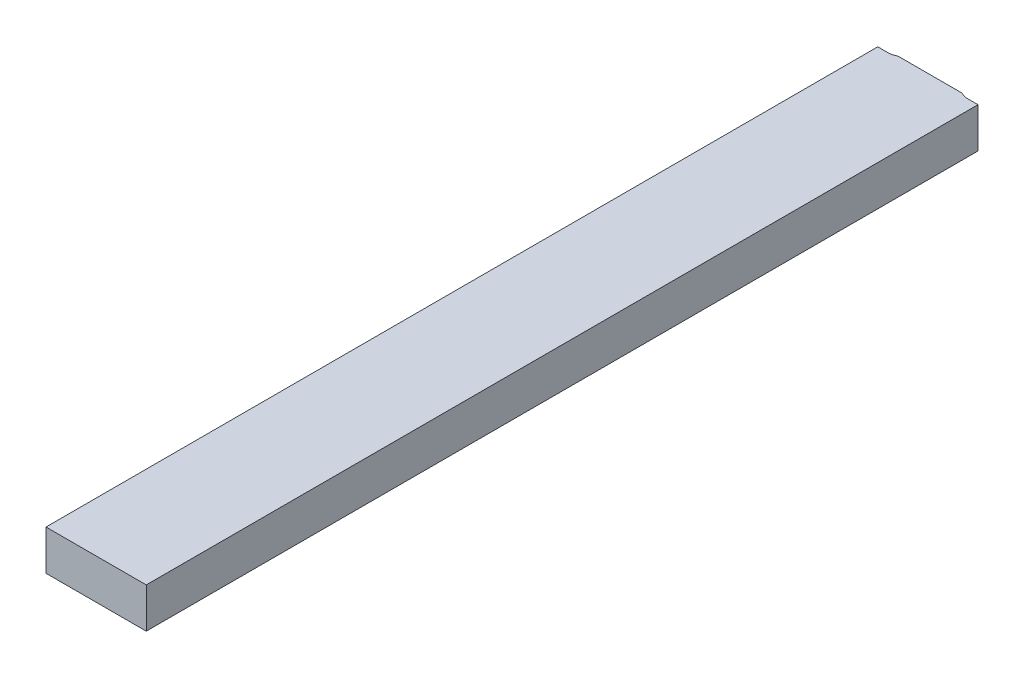
ISO-10303-21;
HEADER;
FILE_DESCRIPTION(('STEP AP214'),'2;1');
FILE_NAME('part.step','',(''),(''),'','','');
FILE_SCHEMA(('AUTOMOTIVE_DESIGN { 1 0 10303 214 1 1 1 1 }'));
ENDSEC;
DATA;
#1=APPLICATION_CONTEXT('core data for automotive mechanical design processes');
#2=APPLICATION_PROTOCOL_DEFINITION('international standard','automotive_design',2000,#1);
#3=PRODUCT_CONTEXT('',#1,'mechanical');
#4=PRODUCT('Part','Part','',(#3));
#5=PRODUCT_RELATED_PRODUCT_CATEGORY('part','',(#4));
#6=PRODUCT_DEFINITION_FORMATION('','',#4);
#7=PRODUCT_DEFINITION_CONTEXT('part definition',#1,'design');
#8=PRODUCT_DEFINITION('design','',#6,#7);
#9=PRODUCT_DEFINITION_SHAPE('','',#8);
#10=(LENGTH_UNIT() NAMED_UNIT(*) SI_UNIT(.MILLI.,.METRE.));
#11=(NAMED_UNIT(*) PLANE_ANGLE_UNIT() SI_UNIT($,.RADIAN.));
#12=(NAMED_UNIT(*) SI_UNIT($,.STERADIAN.) SOLID_ANGLE_UNIT());
#13=UNCERTAINTY_MEASURE_WITH_UNIT(LENGTH_MEASURE(1.E-05),#10,'distance_accuracy_value','');
#14=(GEOMETRIC_REPRESENTATION_CONTEXT(3) GLOBAL_UNCERTAINTY_ASSIGNED_CONTEXT((#13)) GLOBAL_UNIT_ASSIGNED_CONTEXT((#10,
#11,#12)) REPRESENTATION_CONTEXT('',''));
#15=CARTESIAN_POINT('',(0.,0.,0.));
#16=DIRECTION('',(0.,0.,1.));
#17=DIRECTION('',(1.,0.,0.));
#18=AXIS2_PLACEMENT_3D('',#15,#16,#17);
#19=CARTESIAN_POINT('',(-1.5,0.275,-4.982138483571));
#20=DIRECTION('',(0.,1.,0.));
#21=DIRECTION('',(0.,0.,1.));
#22=AXIS2_PLACEMENT_3D('',#19,#20,#21);
#23=PLANE('',#22);
#24=DIRECTION('',(1.,0.,0.));
#25=VECTOR('',#24,1.);
#26=CARTESIAN_POINT('',(-1.725,0.275,-7.051158663985));
#27=LINE('',#26,#25);
#28=CARTESIAN_POINT('',(-1.75,0.275,-7.051158663985));
#29=VERTEX_POINT('',#28);
#30=CARTESIAN_POINT('',(-1.69999999999826,0.275,-7.05115866398515));
#31=VERTEX_POINT('',#30);
#32=EDGE_CURVE('E184',#29,#31,#27,.T.);
#33=ORIENTED_EDGE('',*,*,#32,.T.);
#34=CARTESIAN_POINT('',(-1.66074390617903,0.275,-7.06145062487904));
#35=CARTESIAN_POINT('',(-1.66430562065387,0.275,-7.05943829430755));
#36=CARTESIAN_POINT('',(-1.66802308541288,0.275,-7.05770911016996));
#37=CARTESIAN_POINT('',(-1.675678668398,0.275,-7.05483826908998));
#38=CARTESIAN_POINT('',(-1.67961678669287,0.275,-7.05369661233063));
#39=CARTESIAN_POINT('',(-1.68899940611308,0.275,-7.05173413514556));
#40=CARTESIAN_POINT('',(-1.6944962200161,0.275,-7.05115865434742));
#41=CARTESIAN_POINT('',(-1.69999999999652,0.275,-7.05115866398529));
#42=B_SPLINE_CURVE_WITH_KNOTS('',3,(#34,#35,#36,#37,#38,#39,#40,#41),.UNSPECIFIED.,.F.,.F.,(4,2,
2,4),(0.,0.0122542009828669,0.0245084057837984,0.040976648284799),.UNSPECIFIED.);
#43=CARTESIAN_POINT('',(-1.66074390617903,0.275,-7.06145062487903));
#44=VERTEX_POINT('',#43);
#45=EDGE_CURVE('E93',#44,#31,#42,.T.);
#46=ORIENTED_EDGE('',*,*,#45,.F.);
#47=DIRECTION('',(1.,0.,0.));
#48=VECTOR('',#47,1.);
#49=CARTESIAN_POINT('',(-1.499999951795,0.275,-7.061450624879));
#50=LINE('',#49,#48);
#51=CARTESIAN_POINT('',(-1.339255997412,0.275,-7.06145062487899));
#52=VERTEX_POINT('',#51);
#53=EDGE_CURVE('E89',#44,#52,#50,.T.);
#54=ORIENTED_EDGE('',*,*,#53,.T.);
#55=CARTESIAN_POINT('',(-1.30000000000351,0.275,-7.05115866398509));
#56=CARTESIAN_POINT('',(-1.30408879277278,0.275,-7.05116284562048));
#57=CARTESIAN_POINT('',(-1.30817611333355,0.275,-7.05148113218099));
#58=CARTESIAN_POINT('',(-1.31625667415824,0.275,-7.05273057454798));
#59=CARTESIAN_POINT('',(-1.32024989952298,0.275,-7.05366182674584));
#60=CARTESIAN_POINT('',(-1.32939082766556,0.275,-7.05654480111922));
#61=CARTESIAN_POINT('',(-1.33446335028937,0.275,-7.05873731135742));
#62=CARTESIAN_POINT('',(-1.339255997412,0.275,-7.06145062487899));
#63=B_SPLINE_CURVE_WITH_KNOTS('',3,(#55,#56,#57,#58,#59,#60,#61,#62),.UNSPECIFIED.,.F.,.F.,(4,2,
2,4),(0.,0.0122527379750503,0.0245074032044935,0.0409759652394009),.UNSPECIFIED.);
#64=CARTESIAN_POINT('',(-1.30000000000176,0.275,-7.05115866398505));
#65=VERTEX_POINT('',#64);
#66=EDGE_CURVE('E21',#65,#52,#63,.T.);
#67=ORIENTED_EDGE('',*,*,#66,.F.);
#68=DIRECTION('',(1.,0.,0.));
#69=VECTOR('',#68,1.);
#70=CARTESIAN_POINT('',(-1.275,0.275,-7.051158663985));
#71=LINE('',#70,#69);
#72=CARTESIAN_POINT('',(-1.25,0.275,-7.051158663985));
#73=VERTEX_POINT('',#72);
#74=EDGE_CURVE('E84',#65,#73,#71,.T.);
#75=ORIENTED_EDGE('',*,*,#74,.T.);
#76=DIRECTION('',(0.,0.,-1.));
#77=VECTOR('',#76,1.);
#78=CARTESIAN_POINT('',(-1.25,0.275,-4.976992503125));
#79=LINE('',#78,#77);
#80=CARTESIAN_POINT('',(-1.25,0.275,-2.902826342264));
#81=VERTEX_POINT('',#80);
#82=EDGE_CURVE('E218',#81,#73,#79,.T.);
#83=ORIENTED_EDGE('',*,*,#82,.F.);
#84=DIRECTION('',(1.,0.,0.));
#85=VECTOR('',#84,1.);
#86=CARTESIAN_POINT('',(-1.5,0.275,-2.902826342264));
#87=LINE('',#86,#85);
#88=CARTESIAN_POINT('',(-1.75,0.275,-2.902826342264));
#89=VERTEX_POINT('',#88);
#90=EDGE_CURVE('E204',#89,#81,#87,.T.);
#91=ORIENTED_EDGE('',*,*,#90,.F.);
#92=DIRECTION('',(0.,0.,-1.));
#93=VECTOR('',#92,1.);
#94=CARTESIAN_POINT('',(-1.75,0.275,-4.976992503125));
#95=LINE('',#94,#93);
#96=EDGE_CURVE('E176',#89,#29,#95,.T.);
#97=ORIENTED_EDGE('',*,*,#96,.T.);
#98=EDGE_LOOP('',(#33,#46,#54,#67,#75,#83,#91,#97));
#99=FACE_BOUND('',#98,.T.);
#100=ADVANCED_FACE('F17',(#99),#23,.F.);
#101=CARTESIAN_POINT('',(-1.25,0.375,-4.976992503125));
#102=DIRECTION('',(1.,0.,0.));
#103=DIRECTION('',(0.,0.,-1.));
#104=AXIS2_PLACEMENT_3D('',#101,#102,#103);
#105=PLANE('',#104);
#106=DIRECTION('',(0.,0.,1.));
#107=VECTOR('',#106,1.);
#108=CARTESIAN_POINT('',(-1.25,0.475,-4.982138483571));
#109=LINE('',#108,#107);
#110=CARTESIAN_POINT('',(-1.25,0.475,-2.902826342264));
#111=VERTEX_POINT('',#110);
#112=CARTESIAN_POINT('',(-1.25,0.475,-7.051158663985));
#113=VERTEX_POINT('',#112);
#114=EDGE_CURVE('E189',#111,#113,#109,.F.);
#115=ORIENTED_EDGE('',*,*,#114,.F.);
#116=DIRECTION('',(0.,1.,0.));
#117=VECTOR('',#116,1.);
#118=CARTESIAN_POINT('',(-1.25,0.375,-2.902826342264));
#119=LINE('',#118,#117);
#120=EDGE_CURVE('E203',#81,#111,#119,.T.);
#121=ORIENTED_EDGE('',*,*,#120,.F.);
#122=ORIENTED_EDGE('',*,*,#82,.T.);
#123=DIRECTION('',(0.,1.,0.));
#124=VECTOR('',#123,1.);
#125=CARTESIAN_POINT('',(-1.25,0.375,-7.051158663985));
#126=LINE('',#125,#124);
#127=EDGE_CURVE('E233',#73,#113,#126,.T.);
#128=ORIENTED_EDGE('',*,*,#127,.T.);
#129=EDGE_LOOP('',(#115,#121,#122,#128));
#130=FACE_BOUND('',#129,.T.);
#131=ADVANCED_FACE('F238',(#130),#105,.T.);
#132=CARTESIAN_POINT('',(-1.275,0.375,-7.051158663985));
#133=DIRECTION('',(0.,0.,1.));
#134=DIRECTION('',(1.,0.,0.));
#135=AXIS2_PLACEMENT_3D('',#132,#133,#134);
#136=PLANE('',#135);
#137=DIRECTION('',(1.,0.,0.));
#138=VECTOR('',#137,1.);
#139=CARTESIAN_POINT('',(-1.5,0.475,-7.051158663985));
#140=LINE('',#139,#138);
#141=CARTESIAN_POINT('',(-1.30000007335933,0.475,-7.05115866418437));
#142=VERTEX_POINT('',#141);
#143=EDGE_CURVE('E135',#113,#142,#140,.F.);
#144=ORIENTED_EDGE('',*,*,#143,.F.);
#145=ORIENTED_EDGE('',*,*,#127,.F.);
#146=ORIENTED_EDGE('',*,*,#74,.F.);
#147=DIRECTION('',(0.,1.,0.));
#148=VECTOR('',#147,1.);
#149=CARTESIAN_POINT('',(-1.3,0.2699679840491,-7.05115866398508));
#150=LINE('',#149,#148);
#151=EDGE_CURVE('E103',#142,#65,#150,.F.);
#152=ORIENTED_EDGE('',*,*,#151,.F.);
#153=EDGE_LOOP('',(#144,#145,#146,#152));
#154=FACE_BOUND('',#153,.T.);
#155=ADVANCED_FACE('F125',(#154),#136,.F.);
#156=CARTESIAN_POINT('',(-1.29748039058,0.2699679840491,-7.051190309039));
#157=CARTESIAN_POINT('',(-1.29831958238,0.2699679840491,-7.051166943388));
#158=CARTESIAN_POINT('',(-1.304384997637,0.2699679840491,-7.051090682037));
#159=CARTESIAN_POINT('',(-1.315708586206,0.2699679840491,-7.052195104335));
#160=CARTESIAN_POINT('',(-1.328858649665,0.2699679840491,-7.056177217872));
#161=CARTESIAN_POINT('',(-1.337975877851,0.2699679840491,-7.060613467733));
#162=CARTESIAN_POINT('',(-1.342157497933,0.2699679840491,-7.063145821386));
#163=CARTESIAN_POINT('',(-1.343566222697,0.2699679840491,-7.064061090588));
#164=(BOUNDED_CURVE() B_SPLINE_CURVE(3,(#156,#157,#158,#159,#160,#161,#162,#163),.UNSPECIFIED.,
.F.,.F.) B_SPLINE_CURVE_WITH_KNOTS((4,1,1,1,1,4),(0.,0.05196482602246,0.3752098129395,
0.6983604955075,0.8962889073999,1.),
.UNSPECIFIED.) CURVE() GEOMETRIC_REPRESENTATION_ITEM() RATIONAL_B_SPLINE_CURVE((1.,1.,1.,1.,1.,
1.,1.,1.)) REPRESENTATION_ITEM(''));
#165=DIRECTION('',(0.,1.,0.));
#166=VECTOR('',#165,1.);
#167=SURFACE_OF_LINEAR_EXTRUSION('',#164,#166);
#168=ORIENTED_EDGE('',*,*,#66,.T.);
#169=DIRECTION('',(0.,1.,0.));
#170=VECTOR('',#169,1.);
#171=CARTESIAN_POINT('',(-1.339255997412,0.375,-7.061450624879));
#172=LINE('',#171,#170);
#173=CARTESIAN_POINT('',(-1.339255997412,0.475,-7.061450624879));
#174=VERTEX_POINT('',#173);
#175=EDGE_CURVE('E97',#52,#174,#172,.T.);
#176=ORIENTED_EDGE('',*,*,#175,.T.);
#177=CARTESIAN_POINT('',(-1.30000014671866,0.475,-7.05115866438369));
#178=CARTESIAN_POINT('',(-1.30408893948173,0.475,-7.0511628532203));
#179=CARTESIAN_POINT('',(-1.30817625948793,0.475,-7.05148114713333));
#180=CARTESIAN_POINT('',(-1.3162568180645,0.475,-7.05273060421157));
#181=CARTESIAN_POINT('',(-1.3202500417355,0.475,-7.05366186376829));
#182=CARTESIAN_POINT('',(-1.32939091806165,0.475,-7.05654484039364));
#183=CARTESIAN_POINT('',(-1.33446339307278,0.475,-7.05873733584115));
#184=CARTESIAN_POINT('',(-1.339255997412,0.475,-7.06145062487899));
#185=B_SPLINE_CURVE_WITH_KNOTS('',3,(#177,#178,#179,#180,#181,#182,#183,#184),.UNSPECIFIED.,.F.,
.F.,(4,2,2,4),(0.,0.0122527379884829,0.0245074032339873,0.0409758193004617),.UNSPECIFIED.);
#186=EDGE_CURVE('E129',#142,#174,#185,.T.);
#187=ORIENTED_EDGE('',*,*,#186,.F.);
#188=ORIENTED_EDGE('',*,*,#151,.T.);
#189=EDGE_LOOP('',(#168,#176,#187,#188));
#190=FACE_BOUND('',#189,.T.);
#191=ADVANCED_FACE('F100',(#190),#167,.T.);
#192=CARTESIAN_POINT('',(-1.499999951795,0.375,-7.061450624879));
#193=DIRECTION('',(0.,0.,1.));
#194=DIRECTION('',(1.,0.,0.));
#195=AXIS2_PLACEMENT_3D('',#192,#193,#194);
#196=PLANE('',#195);
#197=ORIENTED_EDGE('',*,*,#53,.F.);
#198=DIRECTION('',(0.,1.,0.));
#199=VECTOR('',#198,1.);
#200=CARTESIAN_POINT('',(-1.66074390617902,0.2699679840491,-7.06145062487904));
#201=LINE('',#200,#199);
#202=CARTESIAN_POINT('',(-1.66074390617902,0.475,-7.06145062487903));
#203=VERTEX_POINT('',#202);
#204=EDGE_CURVE('E109',#203,#44,#201,.F.);
#205=ORIENTED_EDGE('',*,*,#204,.F.);
#206=DIRECTION('',(1.,0.,0.));
#207=VECTOR('',#206,1.);
#208=CARTESIAN_POINT('',(-1.5,0.475,-7.061450624879));
#209=LINE('',#208,#207);
#210=EDGE_CURVE('E106',#174,#203,#209,.F.);
#211=ORIENTED_EDGE('',*,*,#210,.F.);
#212=ORIENTED_EDGE('',*,*,#175,.F.);
#213=EDGE_LOOP('',(#197,#205,#211,#212));
#214=FACE_BOUND('',#213,.T.);
#215=ADVANCED_FACE('F104',(#214),#196,.F.);
#216=CARTESIAN_POINT('',(-1.656433692458,0.2699679840491,-7.064061118802));
#217=CARTESIAN_POINT('',(-1.65784241379,0.2699679840491,-7.063145841608));
#218=CARTESIAN_POINT('',(-1.662021892669,0.2699679840491,-7.060614746012));
#219=CARTESIAN_POINT('',(-1.67113801512,0.2699679840491,-7.056178456814));
#220=CARTESIAN_POINT('',(-1.684287959398,0.2699679840491,-7.052195755785));
#221=CARTESIAN_POINT('',(-1.695613253729,0.2699679840491,-7.051090694486));
#222=CARTESIAN_POINT('',(-1.701678868218,0.2699679840491,-7.051166937919));
#223=CARTESIAN_POINT('',(-1.702517288364,0.2699679840491,-7.051190272618));
#224=(BOUNDED_CURVE() B_SPLINE_CURVE(3,(#216,#217,#218,#219,#220,#221,#222,#223),.UNSPECIFIED.,
.F.,.F.) B_SPLINE_CURVE_WITH_KNOTS((4,1,1,1,1,4),(0.,0.1037158878781,0.3014998794713,
0.6247605212749,0.9480806664175,1.),
.UNSPECIFIED.) CURVE() GEOMETRIC_REPRESENTATION_ITEM() RATIONAL_B_SPLINE_CURVE((1.,1.,1.,1.,1.,
1.,1.,1.)) REPRESENTATION_ITEM(''));
#225=DIRECTION('',(0.,1.,0.));
#226=VECTOR('',#225,1.);
#227=SURFACE_OF_LINEAR_EXTRUSION('',#224,#226);
#228=CARTESIAN_POINT('',(-1.66074390617903,0.475,-7.06145062487904));
#229=CARTESIAN_POINT('',(-1.66430562063098,0.475,-7.05943829433275));
#230=CARTESIAN_POINT('',(-1.66802308540143,0.475,-7.05770911018256));
#231=CARTESIAN_POINT('',(-1.67567866840944,0.475,-7.05483826907738));
#232=CARTESIAN_POINT('',(-1.67961678671575,0.475,-7.05369661230544));
#233=CARTESIAN_POINT('',(-1.68899935836828,0.475,-7.05173414515933));
#234=CARTESIAN_POINT('',(-1.69449612238526,0.475,-7.05115866469184));
#235=CARTESIAN_POINT('',(-1.69999985318857,0.475,-7.05115866438328));
#236=B_SPLINE_CURVE_WITH_KNOTS('',3,(#228,#229,#230,#231,#232,#233,#234,#235),.UNSPECIFIED.,.F.,
.F.,(4,2,2,4),(0.,0.0122542009828671,0.0245084057837982,0.0409765022206903),.UNSPECIFIED.);
#237=CARTESIAN_POINT('',(-1.7,0.475,-7.051158663985));
#238=VERTEX_POINT('',#237);
#239=EDGE_CURVE('E136',#203,#238,#236,.T.);
#240=ORIENTED_EDGE('',*,*,#239,.F.);
#241=ORIENTED_EDGE('',*,*,#204,.T.);
#242=ORIENTED_EDGE('',*,*,#45,.T.);
#243=DIRECTION('',(0.,1.,0.));
#244=VECTOR('',#243,1.);
#245=CARTESIAN_POINT('',(-1.7,0.375,-7.051158663985));
#246=LINE('',#245,#244);
#247=EDGE_CURVE('E182',#31,#238,#246,.T.);
#248=ORIENTED_EDGE('',*,*,#247,.T.);
#249=EDGE_LOOP('',(#240,#241,#242,#248));
#250=FACE_BOUND('',#249,.T.);
#251=ADVANCED_FACE('F159',(#250),#227,.T.);
#252=CARTESIAN_POINT('',(-1.725,0.375,-7.051158663985));
#253=DIRECTION('',(0.,0.,1.));
#254=DIRECTION('',(1.,0.,0.));
#255=AXIS2_PLACEMENT_3D('',#252,#253,#254);
#256=PLANE('',#255);
#257=DIRECTION('',(1.,0.,0.));
#258=VECTOR('',#257,1.);
#259=CARTESIAN_POINT('',(-1.5,0.475,-7.051158663985));
#260=LINE('',#259,#258);
#261=CARTESIAN_POINT('',(-1.75,0.475,-7.051158663985));
#262=VERTEX_POINT('',#261);
#263=EDGE_CURVE('E181',#238,#262,#260,.F.);
#264=ORIENTED_EDGE('',*,*,#263,.F.);
#265=ORIENTED_EDGE('',*,*,#247,.F.);
#266=ORIENTED_EDGE('',*,*,#32,.F.);
#267=DIRECTION('',(0.,1.,0.));
#268=VECTOR('',#267,1.);
#269=CARTESIAN_POINT('',(-1.75,0.375,-7.051158663985));
#270=LINE('',#269,#268);
#271=EDGE_CURVE('E174',#29,#262,#270,.T.);
#272=ORIENTED_EDGE('',*,*,#271,.T.);
#273=EDGE_LOOP('',(#264,#265,#266,#272));
#274=FACE_BOUND('',#273,.T.);
#275=ADVANCED_FACE('F157',(#274),#256,.F.);
#276=CARTESIAN_POINT('',(-1.75,0.375,-4.976992503125));
#277=DIRECTION('',(1.,0.,0.));
#278=DIRECTION('',(0.,0.,-1.));
#279=AXIS2_PLACEMENT_3D('',#276,#277,#278);
#280=PLANE('',#279);
#281=ORIENTED_EDGE('',*,*,#271,.F.);
#282=ORIENTED_EDGE('',*,*,#96,.F.);
#283=DIRECTION('',(0.,1.,0.));
#284=VECTOR('',#283,1.);
#285=CARTESIAN_POINT('',(-1.75,0.375,-2.902826342264));
#286=LINE('',#285,#284);
#287=CARTESIAN_POINT('',(-1.75,0.475,-2.902826342264));
#288=VERTEX_POINT('',#287);
#289=EDGE_CURVE('E40',#288,#89,#286,.F.);
#290=ORIENTED_EDGE('',*,*,#289,.F.);
#291=DIRECTION('',(0.,0.,1.));
#292=VECTOR('',#291,1.);
#293=CARTESIAN_POINT('',(-1.75,0.475,-4.982138483571));
#294=LINE('',#293,#292);
#295=EDGE_CURVE('E31',#262,#288,#294,.T.);
#296=ORIENTED_EDGE('',*,*,#295,.F.);
#297=EDGE_LOOP('',(#281,#282,#290,#296));
#298=FACE_BOUND('',#297,.T.);
#299=ADVANCED_FACE('F153',(#298),#280,.F.);
#300=CARTESIAN_POINT('',(-1.5,0.375,-2.902826342264));
#301=DIRECTION('',(0.,0.,1.));
#302=DIRECTION('',(1.,0.,0.));
#303=AXIS2_PLACEMENT_3D('',#300,#301,#302);
#304=PLANE('',#303);
#305=ORIENTED_EDGE('',*,*,#120,.T.);
#306=DIRECTION('',(1.,0.,0.));
#307=VECTOR('',#306,1.);
#308=CARTESIAN_POINT('',(-1.5,0.475,-2.902826342264));
#309=LINE('',#308,#307);
#310=EDGE_CURVE('E11',#288,#111,#309,.T.);
#311=ORIENTED_EDGE('',*,*,#310,.F.);
#312=ORIENTED_EDGE('',*,*,#289,.T.);
#313=ORIENTED_EDGE('',*,*,#90,.T.);
#314=EDGE_LOOP('',(#305,#311,#312,#313));
#315=FACE_BOUND('',#314,.T.);
#316=ADVANCED_FACE('F148',(#315),#304,.T.);
#317=CARTESIAN_POINT('',(-1.5,0.475,-4.982138483571));
#318=DIRECTION('',(0.,1.,0.));
#319=DIRECTION('',(0.,0.,1.));
#320=AXIS2_PLACEMENT_3D('',#317,#318,#319);
#321=PLANE('',#320);
#322=ORIENTED_EDGE('',*,*,#295,.T.);
#323=ORIENTED_EDGE('',*,*,#310,.T.);
#324=ORIENTED_EDGE('',*,*,#114,.T.);
#325=ORIENTED_EDGE('',*,*,#143,.T.);
#326=ORIENTED_EDGE('',*,*,#186,.T.);
#327=ORIENTED_EDGE('',*,*,#210,.T.);
#328=ORIENTED_EDGE('',*,*,#239,.T.);
#329=ORIENTED_EDGE('',*,*,#263,.T.);
#330=EDGE_LOOP('',(#322,#323,#324,#325,#326,#327,#328,#329));
#331=FACE_BOUND('',#330,.T.);
#332=ADVANCED_FACE('F144',(#331),#321,.T.);
#333=CLOSED_SHELL('',(#100,#131,#155,#191,#215,#251,#275,#299,#316,#332));
#334=MANIFOLD_SOLID_BREP('B1',#333);
#335=ADVANCED_BREP_SHAPE_REPRESENTATION('',(#18,#334),#14);
#336=SHAPE_DEFINITION_REPRESENTATION(#9,#335);
ENDSEC;
END-ISO-10303-21;
